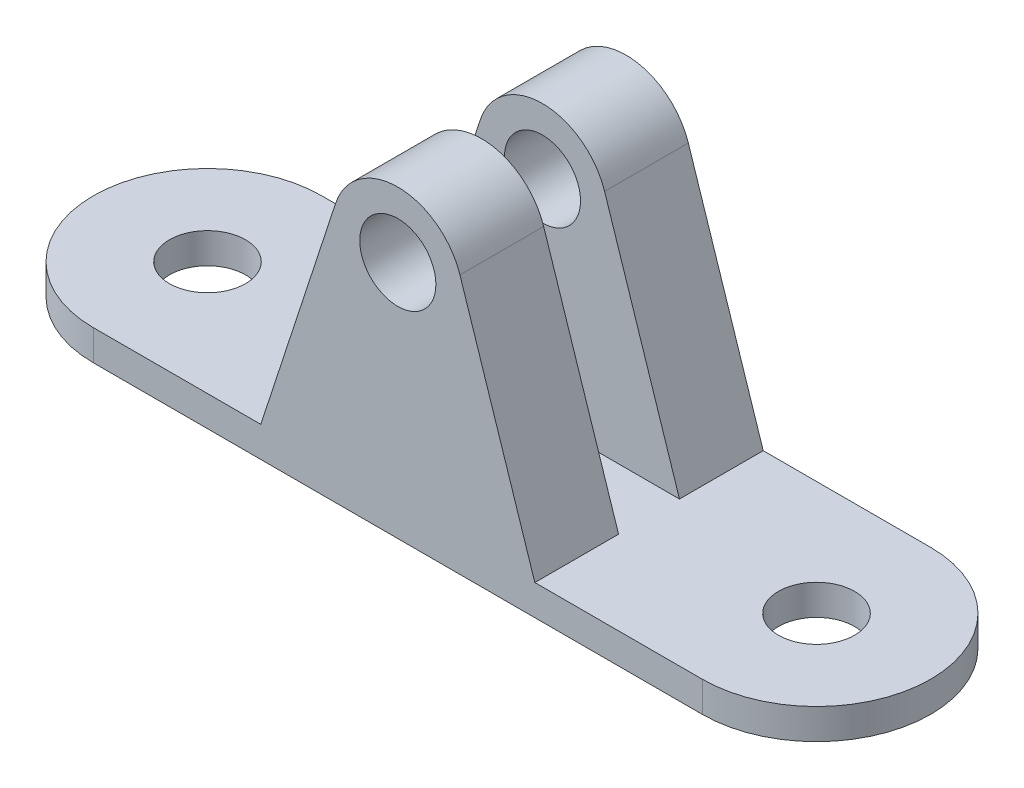
ISO-10303-21;
HEADER;
FILE_DESCRIPTION(('STEP AP214'),'2;1');
FILE_NAME('part.step','',(''),(''),'','','');
FILE_SCHEMA(('AUTOMOTIVE_DESIGN { 1 0 10303 214 1 1 1 1 }'));
ENDSEC;
DATA;
#1=APPLICATION_CONTEXT('core data for automotive mechanical design processes');
#2=APPLICATION_PROTOCOL_DEFINITION('international standard','automotive_design',2000,#1);
#3=PRODUCT_CONTEXT('',#1,'mechanical');
#4=PRODUCT('Part','Part','',(#3));
#5=PRODUCT_RELATED_PRODUCT_CATEGORY('part','',(#4));
#6=PRODUCT_DEFINITION_FORMATION('','',#4);
#7=PRODUCT_DEFINITION_CONTEXT('part definition',#1,'design');
#8=PRODUCT_DEFINITION('design','',#6,#7);
#9=PRODUCT_DEFINITION_SHAPE('','',#8);
#10=(LENGTH_UNIT() NAMED_UNIT(*) SI_UNIT(.MILLI.,.METRE.));
#11=(NAMED_UNIT(*) PLANE_ANGLE_UNIT() SI_UNIT($,.RADIAN.));
#12=(NAMED_UNIT(*) SI_UNIT($,.STERADIAN.) SOLID_ANGLE_UNIT());
#13=UNCERTAINTY_MEASURE_WITH_UNIT(LENGTH_MEASURE(1.E-05),#10,'distance_accuracy_value','');
#14=(GEOMETRIC_REPRESENTATION_CONTEXT(3) GLOBAL_UNCERTAINTY_ASSIGNED_CONTEXT((#13)) GLOBAL_UNIT_ASSIGNED_CONTEXT((#10,
#11,#12)) REPRESENTATION_CONTEXT('',''));
#15=CARTESIAN_POINT('',(0.,0.,0.));
#16=DIRECTION('',(0.,0.,1.));
#17=DIRECTION('',(1.,0.,0.));
#18=AXIS2_PLACEMENT_3D('',#15,#16,#17);
#19=CARTESIAN_POINT('',(0.,2.,0.));
#20=DIRECTION('',(0.,-1.,0.));
#21=DIRECTION('',(0.,0.,-1.));
#22=AXIS2_PLACEMENT_3D('',#19,#20,#21);
#23=CYLINDRICAL_SURFACE('',#22,7.5);
#24=CARTESIAN_POINT('',(0.,0.,0.));
#25=DIRECTION('',(0.,1.,0.));
#26=DIRECTION('',(0.,0.,1.));
#27=AXIS2_PLACEMENT_3D('',#24,#25,#26);
#28=CIRCLE('',#27,7.5);
#29=CARTESIAN_POINT('',(0.,0.,-7.5));
#30=VERTEX_POINT('',#29);
#31=CARTESIAN_POINT('',(0.,0.,7.5));
#32=VERTEX_POINT('',#31);
#33=EDGE_CURVE('E190',#30,#32,#28,.T.);
#34=ORIENTED_EDGE('',*,*,#33,.T.);
#35=DIRECTION('',(0.,-1.,0.));
#36=VECTOR('',#35,1.);
#37=CARTESIAN_POINT('',(0.,2.,7.5));
#38=LINE('',#37,#36);
#39=CARTESIAN_POINT('',(0.,2.,7.5));
#40=VERTEX_POINT('',#39);
#41=EDGE_CURVE('E11',#40,#32,#38,.T.);
#42=ORIENTED_EDGE('',*,*,#41,.F.);
#43=CARTESIAN_POINT('',(0.,2.,0.));
#44=DIRECTION('',(0.,1.,0.));
#45=DIRECTION('',(0.,0.,1.));
#46=AXIS2_PLACEMENT_3D('',#43,#44,#45);
#47=CIRCLE('',#46,7.5);
#48=CARTESIAN_POINT('',(0.,2.,-7.5));
#49=VERTEX_POINT('',#48);
#50=EDGE_CURVE('E198',#49,#40,#47,.T.);
#51=ORIENTED_EDGE('',*,*,#50,.F.);
#52=DIRECTION('',(0.,-1.,0.));
#53=VECTOR('',#52,1.);
#54=CARTESIAN_POINT('',(0.,2.,-7.5));
#55=LINE('',#54,#53);
#56=EDGE_CURVE('E211',#49,#30,#55,.T.);
#57=ORIENTED_EDGE('',*,*,#56,.T.);
#58=EDGE_LOOP('',(#34,#42,#51,#57));
#59=FACE_BOUND('',#58,.T.);
#60=ADVANCED_FACE('F34',(#59),#23,.T.);
#61=CARTESIAN_POINT('',(0.,2.,7.5));
#62=DIRECTION('',(0.,0.,-1.));
#63=DIRECTION('',(-1.,0.,0.));
#64=AXIS2_PLACEMENT_3D('',#61,#62,#63);
#65=PLANE('',#64);
#66=DIRECTION('',(1.,0.,0.));
#67=VECTOR('',#66,1.);
#68=CARTESIAN_POINT('',(0.,0.,7.5));
#69=LINE('',#68,#67);
#70=CARTESIAN_POINT('',(40.,0.,7.5));
#71=VERTEX_POINT('',#70);
#72=EDGE_CURVE('E214',#32,#71,#69,.T.);
#73=ORIENTED_EDGE('',*,*,#72,.T.);
#74=DIRECTION('',(0.,-1.,0.));
#75=VECTOR('',#74,1.);
#76=CARTESIAN_POINT('',(40.,2.,7.5));
#77=LINE('',#76,#75);
#78=CARTESIAN_POINT('',(40.,2.,7.5));
#79=VERTEX_POINT('',#78);
#80=EDGE_CURVE('E41',#79,#71,#77,.T.);
#81=ORIENTED_EDGE('',*,*,#80,.F.);
#82=DIRECTION('',(1.,0.,0.));
#83=VECTOR('',#82,1.);
#84=CARTESIAN_POINT('',(0.,2.,7.5));
#85=LINE('',#84,#83);
#86=CARTESIAN_POINT('',(29.,2.,7.5));
#87=VERTEX_POINT('',#86);
#88=EDGE_CURVE('E201',#87,#79,#85,.T.);
#89=ORIENTED_EDGE('',*,*,#88,.F.);
#90=DIRECTION('',(-0.310829426181981,0.950465711017173,0.));
#91=VECTOR('',#90,1.);
#92=CARTESIAN_POINT('',(26.7890323898843,8.76077849963362,7.5));
#93=LINE('',#92,#91);
#94=CARTESIAN_POINT('',(24.0812491263114,17.0407382721211,7.5));
#95=VERTEX_POINT('',#94);
#96=EDGE_CURVE('E169',#87,#95,#93,.T.);
#97=ORIENTED_EDGE('',*,*,#96,.T.);
#98=CARTESIAN_POINT('',(20.,15.7060532757739,7.5));
#99=DIRECTION('',(0.,0.,1.));
#100=DIRECTION('',(1.,0.,0.));
#101=AXIS2_PLACEMENT_3D('',#98,#99,#100);
#102=CIRCLE('',#101,4.29394672422609);
#103=CARTESIAN_POINT('',(15.9187508736886,17.0407382721211,7.5));
#104=VERTEX_POINT('',#103);
#105=EDGE_CURVE('E181',#104,#95,#102,.F.);
#106=ORIENTED_EDGE('',*,*,#105,.F.);
#107=DIRECTION('',(0.310829426181981,0.950465711017173,0.));
#108=VECTOR('',#107,1.);
#109=CARTESIAN_POINT('',(9.34637032289095,-3.05652996281104,7.5));
#110=LINE('',#109,#108);
#111=CARTESIAN_POINT('',(11.,2.,7.5));
#112=VERTEX_POINT('',#111);
#113=EDGE_CURVE('E184',#112,#104,#110,.T.);
#114=ORIENTED_EDGE('',*,*,#113,.F.);
#115=EDGE_CURVE('E203',#40,#112,#85,.T.);
#116=ORIENTED_EDGE('',*,*,#115,.F.);
#117=ORIENTED_EDGE('',*,*,#41,.T.);
#118=EDGE_LOOP('',(#73,#81,#89,#97,#106,#114,#116,#117));
#119=FACE_BOUND('',#118,.T.);
#120=CARTESIAN_POINT('',(20.,15.7060532757739,7.5));
#121=DIRECTION('',(0.,0.,1.));
#122=DIRECTION('',(1.,0.,0.));
#123=AXIS2_PLACEMENT_3D('',#120,#121,#122);
#124=CIRCLE('',#123,2.5);
#125=CARTESIAN_POINT('',(22.5,15.7060532757739,7.5));
#126=VERTEX_POINT('',#125);
#127=EDGE_CURVE('E161',#126,#126,#124,.T.);
#128=ORIENTED_EDGE('',*,*,#127,.F.);
#129=EDGE_LOOP('',(#128));
#130=FACE_BOUND('',#129,.T.);
#131=ADVANCED_FACE('F263',(#119,#130),#65,.F.);
#132=CARTESIAN_POINT('',(40.,2.,0.));
#133=DIRECTION('',(0.,-1.,0.));
#134=DIRECTION('',(0.,0.,-1.));
#135=AXIS2_PLACEMENT_3D('',#132,#133,#134);
#136=CYLINDRICAL_SURFACE('',#135,7.5);
#137=CARTESIAN_POINT('',(40.,0.,0.));
#138=DIRECTION('',(0.,1.,0.));
#139=DIRECTION('',(0.,0.,1.));
#140=AXIS2_PLACEMENT_3D('',#137,#138,#139);
#141=CIRCLE('',#140,7.5);
#142=CARTESIAN_POINT('',(40.,0.,-7.5));
#143=VERTEX_POINT('',#142);
#144=EDGE_CURVE('E216',#71,#143,#141,.T.);
#145=ORIENTED_EDGE('',*,*,#144,.T.);
#146=DIRECTION('',(0.,-1.,0.));
#147=VECTOR('',#146,1.);
#148=CARTESIAN_POINT('',(40.,2.,-7.5));
#149=LINE('',#148,#147);
#150=CARTESIAN_POINT('',(40.,2.,-7.5));
#151=VERTEX_POINT('',#150);
#152=EDGE_CURVE('E221',#151,#143,#149,.T.);
#153=ORIENTED_EDGE('',*,*,#152,.F.);
#154=CARTESIAN_POINT('',(40.,2.,0.));
#155=DIRECTION('',(0.,1.,0.));
#156=DIRECTION('',(0.,0.,1.));
#157=AXIS2_PLACEMENT_3D('',#154,#155,#156);
#158=CIRCLE('',#157,7.5);
#159=EDGE_CURVE('E206',#79,#151,#158,.T.);
#160=ORIENTED_EDGE('',*,*,#159,.F.);
#161=ORIENTED_EDGE('',*,*,#80,.T.);
#162=EDGE_LOOP('',(#145,#153,#160,#161));
#163=FACE_BOUND('',#162,.T.);
#164=ADVANCED_FACE('F228',(#163),#136,.T.);
#165=CARTESIAN_POINT('',(0.,2.,-7.5));
#166=DIRECTION('',(0.,0.,1.));
#167=DIRECTION('',(1.,0.,0.));
#168=AXIS2_PLACEMENT_3D('',#165,#166,#167);
#169=PLANE('',#168);
#170=DIRECTION('',(-1.,0.,0.));
#171=VECTOR('',#170,1.);
#172=CARTESIAN_POINT('',(0.,0.,-7.5));
#173=LINE('',#172,#171);
#174=EDGE_CURVE('E202',#143,#30,#173,.T.);
#175=ORIENTED_EDGE('',*,*,#174,.T.);
#176=ORIENTED_EDGE('',*,*,#56,.F.);
#177=DIRECTION('',(-1.,0.,0.));
#178=VECTOR('',#177,1.);
#179=CARTESIAN_POINT('',(0.,2.,-7.5));
#180=LINE('',#179,#178);
#181=CARTESIAN_POINT('',(11.,2.,-7.5));
#182=VERTEX_POINT('',#181);
#183=EDGE_CURVE('E208',#182,#49,#180,.T.);
#184=ORIENTED_EDGE('',*,*,#183,.F.);
#185=DIRECTION('',(0.310829426181981,0.950465711017173,0.));
#186=VECTOR('',#185,1.);
#187=CARTESIAN_POINT('',(9.34637032289095,-3.05652996281104,-7.5));
#188=LINE('',#187,#186);
#189=CARTESIAN_POINT('',(15.9187508736886,17.0407382721211,-7.5));
#190=VERTEX_POINT('',#189);
#191=EDGE_CURVE('E145',#182,#190,#188,.T.);
#192=ORIENTED_EDGE('',*,*,#191,.T.);
#193=CARTESIAN_POINT('',(20.,15.7060532757739,-7.5));
#194=DIRECTION('',(0.,0.,1.));
#195=DIRECTION('',(1.,0.,0.));
#196=AXIS2_PLACEMENT_3D('',#193,#194,#195);
#197=CIRCLE('',#196,4.29394672422609);
#198=CARTESIAN_POINT('',(24.0812491263114,17.0407382721211,-7.5));
#199=VERTEX_POINT('',#198);
#200=EDGE_CURVE('E154',#190,#199,#197,.F.);
#201=ORIENTED_EDGE('',*,*,#200,.T.);
#202=DIRECTION('',(-0.310829426181981,0.950465711017173,0.));
#203=VECTOR('',#202,1.);
#204=CARTESIAN_POINT('',(26.7890323898843,8.76077849963362,-7.5));
#205=LINE('',#204,#203);
#206=CARTESIAN_POINT('',(29.,2.,-7.5));
#207=VERTEX_POINT('',#206);
#208=EDGE_CURVE('E134',#207,#199,#205,.T.);
#209=ORIENTED_EDGE('',*,*,#208,.F.);
#210=EDGE_CURVE('E209',#151,#207,#180,.T.);
#211=ORIENTED_EDGE('',*,*,#210,.F.);
#212=ORIENTED_EDGE('',*,*,#152,.T.);
#213=EDGE_LOOP('',(#175,#176,#184,#192,#201,#209,#211,#212));
#214=FACE_BOUND('',#213,.T.);
#215=CARTESIAN_POINT('',(20.,15.7060532757739,-7.5));
#216=DIRECTION('',(0.,0.,1.));
#217=DIRECTION('',(1.,0.,0.));
#218=AXIS2_PLACEMENT_3D('',#215,#216,#217);
#219=CIRCLE('',#218,2.5);
#220=CARTESIAN_POINT('',(22.5,15.7060532757739,-7.5));
#221=VERTEX_POINT('',#220);
#222=EDGE_CURVE('E151',#221,#221,#219,.T.);
#223=ORIENTED_EDGE('',*,*,#222,.T.);
#224=EDGE_LOOP('',(#223));
#225=FACE_BOUND('',#224,.T.);
#226=ADVANCED_FACE('F238',(#214,#225),#169,.F.);
#227=CARTESIAN_POINT('',(0.,2.,0.));
#228=DIRECTION('',(0.,1.,0.));
#229=DIRECTION('',(0.,0.,1.));
#230=AXIS2_PLACEMENT_3D('',#227,#228,#229);
#231=PLANE('',#230);
#232=CARTESIAN_POINT('',(40.,2.,0.));
#233=DIRECTION('',(0.,1.,0.));
#234=DIRECTION('',(0.,0.,1.));
#235=AXIS2_PLACEMENT_3D('',#232,#233,#234);
#236=CIRCLE('',#235,2.5);
#237=CARTESIAN_POINT('',(40.,2.,2.5));
#238=VERTEX_POINT('',#237);
#239=EDGE_CURVE('E323',#238,#238,#236,.T.);
#240=ORIENTED_EDGE('',*,*,#239,.F.);
#241=EDGE_LOOP('',(#240));
#242=FACE_BOUND('',#241,.T.);
#243=CARTESIAN_POINT('',(0.,2.,0.));
#244=DIRECTION('',(0.,1.,0.));
#245=DIRECTION('',(0.,0.,1.));
#246=AXIS2_PLACEMENT_3D('',#243,#244,#245);
#247=CIRCLE('',#246,2.5);
#248=CARTESIAN_POINT('',(0.,2.,2.5));
#249=VERTEX_POINT('',#248);
#250=EDGE_CURVE('E325',#249,#249,#247,.T.);
#251=ORIENTED_EDGE('',*,*,#250,.F.);
#252=EDGE_LOOP('',(#251));
#253=FACE_BOUND('',#252,.T.);
#254=DIRECTION('',(0.,0.,-1.));
#255=VECTOR('',#254,1.);
#256=CARTESIAN_POINT('',(11.,2.,-2.));
#257=LINE('',#256,#255);
#258=CARTESIAN_POINT('',(11.,2.,-2.));
#259=VERTEX_POINT('',#258);
#260=EDGE_CURVE('E162',#259,#182,#257,.T.);
#261=ORIENTED_EDGE('',*,*,#260,.T.);
#262=ORIENTED_EDGE('',*,*,#183,.T.);
#263=ORIENTED_EDGE('',*,*,#50,.T.);
#264=ORIENTED_EDGE('',*,*,#115,.T.);
#265=DIRECTION('',(0.,0.,1.));
#266=VECTOR('',#265,1.);
#267=CARTESIAN_POINT('',(11.,2.,2.));
#268=LINE('',#267,#266);
#269=CARTESIAN_POINT('',(11.,2.,2.));
#270=VERTEX_POINT('',#269);
#271=EDGE_CURVE('E194',#270,#112,#268,.T.);
#272=ORIENTED_EDGE('',*,*,#271,.F.);
#273=DIRECTION('',(-1.,0.,0.));
#274=VECTOR('',#273,1.);
#275=CARTESIAN_POINT('',(0.,2.,2.));
#276=LINE('',#275,#274);
#277=CARTESIAN_POINT('',(29.,2.,2.));
#278=VERTEX_POINT('',#277);
#279=EDGE_CURVE('E173',#278,#270,#276,.T.);
#280=ORIENTED_EDGE('',*,*,#279,.F.);
#281=DIRECTION('',(0.,0.,1.));
#282=VECTOR('',#281,1.);
#283=CARTESIAN_POINT('',(29.,2.,2.));
#284=LINE('',#283,#282);
#285=EDGE_CURVE('E191',#278,#87,#284,.T.);
#286=ORIENTED_EDGE('',*,*,#285,.T.);
#287=ORIENTED_EDGE('',*,*,#88,.T.);
#288=ORIENTED_EDGE('',*,*,#159,.T.);
#289=ORIENTED_EDGE('',*,*,#210,.T.);
#290=DIRECTION('',(0.,0.,-1.));
#291=VECTOR('',#290,1.);
#292=CARTESIAN_POINT('',(29.,2.,-2.));
#293=LINE('',#292,#291);
#294=CARTESIAN_POINT('',(29.,2.,-2.));
#295=VERTEX_POINT('',#294);
#296=EDGE_CURVE('E53',#295,#207,#293,.T.);
#297=ORIENTED_EDGE('',*,*,#296,.F.);
#298=DIRECTION('',(-1.,0.,0.));
#299=VECTOR('',#298,1.);
#300=CARTESIAN_POINT('',(0.,2.,-2.));
#301=LINE('',#300,#299);
#302=EDGE_CURVE('E48',#295,#259,#301,.T.);
#303=ORIENTED_EDGE('',*,*,#302,.T.);
#304=EDGE_LOOP('',(#261,#262,#263,#264,#272,#280,#286,#287,#288,#289,#297,#303));
#305=FACE_BOUND('',#304,.T.);
#306=ADVANCED_FACE('F244',(#242,#253,#305),#231,.T.);
#307=CARTESIAN_POINT('',(0.,0.,0.));
#308=DIRECTION('',(0.,1.,0.));
#309=DIRECTION('',(0.,0.,1.));
#310=AXIS2_PLACEMENT_3D('',#307,#308,#309);
#311=PLANE('',#310);
#312=CARTESIAN_POINT('',(40.,0.,0.));
#313=DIRECTION('',(0.,1.,0.));
#314=DIRECTION('',(0.,0.,1.));
#315=AXIS2_PLACEMENT_3D('',#312,#313,#314);
#316=CIRCLE('',#315,2.5);
#317=CARTESIAN_POINT('',(40.,0.,2.5));
#318=VERTEX_POINT('',#317);
#319=EDGE_CURVE('E320',#318,#318,#316,.T.);
#320=ORIENTED_EDGE('',*,*,#319,.T.);
#321=EDGE_LOOP('',(#320));
#322=FACE_BOUND('',#321,.T.);
#323=CARTESIAN_POINT('',(0.,0.,0.));
#324=DIRECTION('',(0.,1.,0.));
#325=DIRECTION('',(0.,0.,1.));
#326=AXIS2_PLACEMENT_3D('',#323,#324,#325);
#327=CIRCLE('',#326,2.5);
#328=CARTESIAN_POINT('',(0.,0.,2.5));
#329=VERTEX_POINT('',#328);
#330=EDGE_CURVE('E155',#329,#329,#327,.T.);
#331=ORIENTED_EDGE('',*,*,#330,.T.);
#332=EDGE_LOOP('',(#331));
#333=FACE_BOUND('',#332,.T.);
#334=ORIENTED_EDGE('',*,*,#33,.F.);
#335=ORIENTED_EDGE('',*,*,#174,.F.);
#336=ORIENTED_EDGE('',*,*,#144,.F.);
#337=ORIENTED_EDGE('',*,*,#72,.F.);
#338=EDGE_LOOP('',(#334,#335,#336,#337));
#339=FACE_BOUND('',#338,.T.);
#340=ADVANCED_FACE('F235',(#322,#333,#339),#311,.F.);
#341=CARTESIAN_POINT('',(20.,15.7060532757739,2.));
#342=DIRECTION('',(0.,0.,1.));
#343=DIRECTION('',(1.,0.,0.));
#344=AXIS2_PLACEMENT_3D('',#341,#342,#343);
#345=CYLINDRICAL_SURFACE('',#344,4.29394672422609);
#346=ORIENTED_EDGE('',*,*,#105,.T.);
#347=DIRECTION('',(0.,0.,1.));
#348=VECTOR('',#347,1.);
#349=CARTESIAN_POINT('',(24.0812491263114,17.0407382721211,2.));
#350=LINE('',#349,#348);
#351=CARTESIAN_POINT('',(24.0812491263114,17.0407382721211,2.));
#352=VERTEX_POINT('',#351);
#353=EDGE_CURVE('E188',#352,#95,#350,.T.);
#354=ORIENTED_EDGE('',*,*,#353,.F.);
#355=CARTESIAN_POINT('',(20.,15.7060532757739,2.));
#356=DIRECTION('',(0.,0.,1.));
#357=DIRECTION('',(1.,0.,0.));
#358=AXIS2_PLACEMENT_3D('',#355,#356,#357);
#359=CIRCLE('',#358,4.29394672422609);
#360=CARTESIAN_POINT('',(15.9187508736886,17.0407382721211,2.));
#361=VERTEX_POINT('',#360);
#362=EDGE_CURVE('E168',#361,#352,#359,.F.);
#363=ORIENTED_EDGE('',*,*,#362,.F.);
#364=DIRECTION('',(0.,0.,1.));
#365=VECTOR('',#364,1.);
#366=CARTESIAN_POINT('',(15.9187508736886,17.0407382721211,2.));
#367=LINE('',#366,#365);
#368=EDGE_CURVE('E178',#361,#104,#367,.T.);
#369=ORIENTED_EDGE('',*,*,#368,.T.);
#370=EDGE_LOOP('',(#346,#354,#363,#369));
#371=FACE_BOUND('',#370,.T.);
#372=ADVANCED_FACE('F277',(#371),#345,.T.);
#373=CARTESIAN_POINT('',(26.7890323898843,8.76077849963362,2.));
#374=DIRECTION('',(0.950465711017173,0.310829426181981,0.));
#375=DIRECTION('',(-0.310829426181981,0.950465711017173,0.));
#376=AXIS2_PLACEMENT_3D('',#373,#374,#375);
#377=PLANE('',#376);
#378=ORIENTED_EDGE('',*,*,#96,.F.);
#379=ORIENTED_EDGE('',*,*,#285,.F.);
#380=DIRECTION('',(-0.310829426181981,0.950465711017173,0.));
#381=VECTOR('',#380,1.);
#382=CARTESIAN_POINT('',(26.7890323898843,8.76077849963362,2.));
#383=LINE('',#382,#381);
#384=EDGE_CURVE('E175',#278,#352,#383,.T.);
#385=ORIENTED_EDGE('',*,*,#384,.T.);
#386=ORIENTED_EDGE('',*,*,#353,.T.);
#387=EDGE_LOOP('',(#378,#379,#385,#386));
#388=FACE_BOUND('',#387,.T.);
#389=ADVANCED_FACE('F286',(#388),#377,.T.);
#390=CARTESIAN_POINT('',(20.,15.7060532757739,2.));
#391=DIRECTION('',(0.,0.,1.));
#392=DIRECTION('',(1.,0.,0.));
#393=AXIS2_PLACEMENT_3D('',#390,#391,#392);
#394=CYLINDRICAL_SURFACE('',#393,2.5);
#395=CARTESIAN_POINT('',(20.,15.7060532757739,2.));
#396=DIRECTION('',(0.,0.,1.));
#397=DIRECTION('',(1.,0.,0.));
#398=AXIS2_PLACEMENT_3D('',#395,#396,#397);
#399=CIRCLE('',#398,2.5);
#400=CARTESIAN_POINT('',(22.5,15.7060532757739,2.));
#401=VERTEX_POINT('',#400);
#402=EDGE_CURVE('E165',#401,#401,#399,.T.);
#403=ORIENTED_EDGE('',*,*,#402,.F.);
#404=EDGE_LOOP('',(#403));
#405=FACE_BOUND('',#404,.T.);
#406=ORIENTED_EDGE('',*,*,#127,.T.);
#407=EDGE_LOOP('',(#406));
#408=FACE_BOUND('',#407,.T.);
#409=ADVANCED_FACE('F282',(#405,#408),#394,.F.);
#410=CARTESIAN_POINT('',(9.34637032289095,-3.05652996281104,2.));
#411=DIRECTION('',(0.950465711017173,-0.310829426181981,0.));
#412=DIRECTION('',(0.310829426181981,0.950465711017173,0.));
#413=AXIS2_PLACEMENT_3D('',#410,#411,#412);
#414=PLANE('',#413);
#415=ORIENTED_EDGE('',*,*,#113,.T.);
#416=ORIENTED_EDGE('',*,*,#368,.F.);
#417=DIRECTION('',(0.310829426181981,0.950465711017173,0.));
#418=VECTOR('',#417,1.);
#419=CARTESIAN_POINT('',(9.34637032289095,-3.05652996281104,2.));
#420=LINE('',#419,#418);
#421=EDGE_CURVE('E171',#270,#361,#420,.T.);
#422=ORIENTED_EDGE('',*,*,#421,.F.);
#423=ORIENTED_EDGE('',*,*,#271,.T.);
#424=EDGE_LOOP('',(#415,#416,#422,#423));
#425=FACE_BOUND('',#424,.T.);
#426=ADVANCED_FACE('F285',(#425),#414,.F.);
#427=CARTESIAN_POINT('',(0.,0.,2.));
#428=DIRECTION('',(0.,0.,1.));
#429=DIRECTION('',(1.,0.,0.));
#430=AXIS2_PLACEMENT_3D('',#427,#428,#429);
#431=PLANE('',#430);
#432=ORIENTED_EDGE('',*,*,#402,.T.);
#433=EDGE_LOOP('',(#432));
#434=FACE_BOUND('',#433,.T.);
#435=ORIENTED_EDGE('',*,*,#362,.T.);
#436=ORIENTED_EDGE('',*,*,#384,.F.);
#437=ORIENTED_EDGE('',*,*,#279,.T.);
#438=ORIENTED_EDGE('',*,*,#421,.T.);
#439=EDGE_LOOP('',(#435,#436,#437,#438));
#440=FACE_BOUND('',#439,.T.);
#441=ADVANCED_FACE('F258',(#434,#440),#431,.F.);
#442=CARTESIAN_POINT('',(20.,15.7060532757739,-2.));
#443=DIRECTION('',(0.,0.,-1.));
#444=DIRECTION('',(-1.,0.,0.));
#445=AXIS2_PLACEMENT_3D('',#442,#443,#444);
#446=CYLINDRICAL_SURFACE('',#445,4.29394672422609);
#447=ORIENTED_EDGE('',*,*,#200,.F.);
#448=DIRECTION('',(0.,0.,-1.));
#449=VECTOR('',#448,1.);
#450=CARTESIAN_POINT('',(15.9187508736886,17.0407382721211,-2.));
#451=LINE('',#450,#449);
#452=CARTESIAN_POINT('',(15.9187508736886,17.0407382721211,-2.));
#453=VERTEX_POINT('',#452);
#454=EDGE_CURVE('E141',#453,#190,#451,.T.);
#455=ORIENTED_EDGE('',*,*,#454,.F.);
#456=CARTESIAN_POINT('',(20.,15.7060532757739,-2.));
#457=DIRECTION('',(0.,0.,1.));
#458=DIRECTION('',(1.,0.,0.));
#459=AXIS2_PLACEMENT_3D('',#456,#457,#458);
#460=CIRCLE('',#459,4.29394672422609);
#461=CARTESIAN_POINT('',(24.0812491263114,17.0407382721211,-2.));
#462=VERTEX_POINT('',#461);
#463=EDGE_CURVE('E126',#453,#462,#460,.F.);
#464=ORIENTED_EDGE('',*,*,#463,.T.);
#465=DIRECTION('',(0.,0.,-1.));
#466=VECTOR('',#465,1.);
#467=CARTESIAN_POINT('',(24.0812491263114,17.0407382721211,-2.));
#468=LINE('',#467,#466);
#469=EDGE_CURVE('E131',#462,#199,#468,.T.);
#470=ORIENTED_EDGE('',*,*,#469,.T.);
#471=EDGE_LOOP('',(#447,#455,#464,#470));
#472=FACE_BOUND('',#471,.T.);
#473=ADVANCED_FACE('F140',(#472),#446,.T.);
#474=CARTESIAN_POINT('',(9.34637032289095,-3.05652996281104,-2.));
#475=DIRECTION('',(-0.950465711017173,0.310829426181981,0.));
#476=DIRECTION('',(-0.310829426181981,-0.950465711017173,0.));
#477=AXIS2_PLACEMENT_3D('',#474,#475,#476);
#478=PLANE('',#477);
#479=ORIENTED_EDGE('',*,*,#191,.F.);
#480=ORIENTED_EDGE('',*,*,#260,.F.);
#481=DIRECTION('',(0.310829426181981,0.950465711017173,0.));
#482=VECTOR('',#481,1.);
#483=CARTESIAN_POINT('',(9.34637032289095,-3.05652996281104,-2.));
#484=LINE('',#483,#482);
#485=EDGE_CURVE('E138',#259,#453,#484,.T.);
#486=ORIENTED_EDGE('',*,*,#485,.T.);
#487=ORIENTED_EDGE('',*,*,#454,.T.);
#488=EDGE_LOOP('',(#479,#480,#486,#487));
#489=FACE_BOUND('',#488,.T.);
#490=ADVANCED_FACE('F248',(#489),#478,.T.);
#491=CARTESIAN_POINT('',(20.,15.7060532757739,-2.));
#492=DIRECTION('',(0.,0.,-1.));
#493=DIRECTION('',(-1.,0.,0.));
#494=AXIS2_PLACEMENT_3D('',#491,#492,#493);
#495=CYLINDRICAL_SURFACE('',#494,2.5);
#496=CARTESIAN_POINT('',(20.,15.7060532757739,-2.));
#497=DIRECTION('',(0.,0.,1.));
#498=DIRECTION('',(1.,0.,0.));
#499=AXIS2_PLACEMENT_3D('',#496,#497,#498);
#500=CIRCLE('',#499,2.5);
#501=CARTESIAN_POINT('',(22.5,15.7060532757739,-2.));
#502=VERTEX_POINT('',#501);
#503=EDGE_CURVE('E142',#502,#502,#500,.T.);
#504=ORIENTED_EDGE('',*,*,#503,.T.);
#505=EDGE_LOOP('',(#504));
#506=FACE_BOUND('',#505,.T.);
#507=ORIENTED_EDGE('',*,*,#222,.F.);
#508=EDGE_LOOP('',(#507));
#509=FACE_BOUND('',#508,.T.);
#510=ADVANCED_FACE('F250',(#506,#509),#495,.F.);
#511=CARTESIAN_POINT('',(26.7890323898843,8.76077849963362,-2.));
#512=DIRECTION('',(-0.950465711017173,-0.310829426181981,0.));
#513=DIRECTION('',(0.310829426181981,-0.950465711017173,0.));
#514=AXIS2_PLACEMENT_3D('',#511,#512,#513);
#515=PLANE('',#514);
#516=ORIENTED_EDGE('',*,*,#208,.T.);
#517=ORIENTED_EDGE('',*,*,#469,.F.);
#518=DIRECTION('',(-0.310829426181981,0.950465711017173,0.));
#519=VECTOR('',#518,1.);
#520=CARTESIAN_POINT('',(26.7890323898843,8.76077849963362,-2.));
#521=LINE('',#520,#519);
#522=EDGE_CURVE('E121',#295,#462,#521,.T.);
#523=ORIENTED_EDGE('',*,*,#522,.F.);
#524=ORIENTED_EDGE('',*,*,#296,.T.);
#525=EDGE_LOOP('',(#516,#517,#523,#524));
#526=FACE_BOUND('',#525,.T.);
#527=ADVANCED_FACE('F132',(#526),#515,.F.);
#528=CARTESIAN_POINT('',(0.,0.,-2.));
#529=DIRECTION('',(0.,0.,-1.));
#530=DIRECTION('',(1.,0.,0.));
#531=AXIS2_PLACEMENT_3D('',#528,#529,#530);
#532=PLANE('',#531);
#533=ORIENTED_EDGE('',*,*,#503,.F.);
#534=EDGE_LOOP('',(#533));
#535=FACE_BOUND('',#534,.T.);
#536=ORIENTED_EDGE('',*,*,#463,.F.);
#537=ORIENTED_EDGE('',*,*,#485,.F.);
#538=ORIENTED_EDGE('',*,*,#302,.F.);
#539=ORIENTED_EDGE('',*,*,#522,.T.);
#540=EDGE_LOOP('',(#536,#537,#538,#539));
#541=FACE_BOUND('',#540,.T.);
#542=ADVANCED_FACE('F123',(#535,#541),#532,.F.);
#543=CARTESIAN_POINT('',(0.,0.,0.));
#544=DIRECTION('',(0.,1.,0.));
#545=DIRECTION('',(0.,0.,1.));
#546=AXIS2_PLACEMENT_3D('',#543,#544,#545);
#547=CYLINDRICAL_SURFACE('',#546,2.5);
#548=ORIENTED_EDGE('',*,*,#330,.F.);
#549=EDGE_LOOP('',(#548));
#550=FACE_BOUND('',#549,.T.);
#551=ORIENTED_EDGE('',*,*,#250,.T.);
#552=EDGE_LOOP('',(#551));
#553=FACE_BOUND('',#552,.T.);
#554=ADVANCED_FACE('F303',(#550,#553),#547,.F.);
#555=CARTESIAN_POINT('',(40.,0.,0.));
#556=DIRECTION('',(0.,1.,0.));
#557=DIRECTION('',(0.,0.,1.));
#558=AXIS2_PLACEMENT_3D('',#555,#556,#557);
#559=CYLINDRICAL_SURFACE('',#558,2.5);
#560=ORIENTED_EDGE('',*,*,#319,.F.);
#561=EDGE_LOOP('',(#560));
#562=FACE_BOUND('',#561,.T.);
#563=ORIENTED_EDGE('',*,*,#239,.T.);
#564=EDGE_LOOP('',(#563));
#565=FACE_BOUND('',#564,.T.);
#566=ADVANCED_FACE('F308',(#562,#565),#559,.F.);
#567=CLOSED_SHELL('',(#60,#131,#164,#226,#306,#340,#372,#389,#409,#426,#441,#473,#490,#510,#527,
#542,#554,#566));
#568=MANIFOLD_SOLID_BREP('B2',#567);
#569=ADVANCED_BREP_SHAPE_REPRESENTATION('',(#18,#568),#14);
#570=SHAPE_DEFINITION_REPRESENTATION(#9,#569);
ENDSEC;
END-ISO-10303-21;
